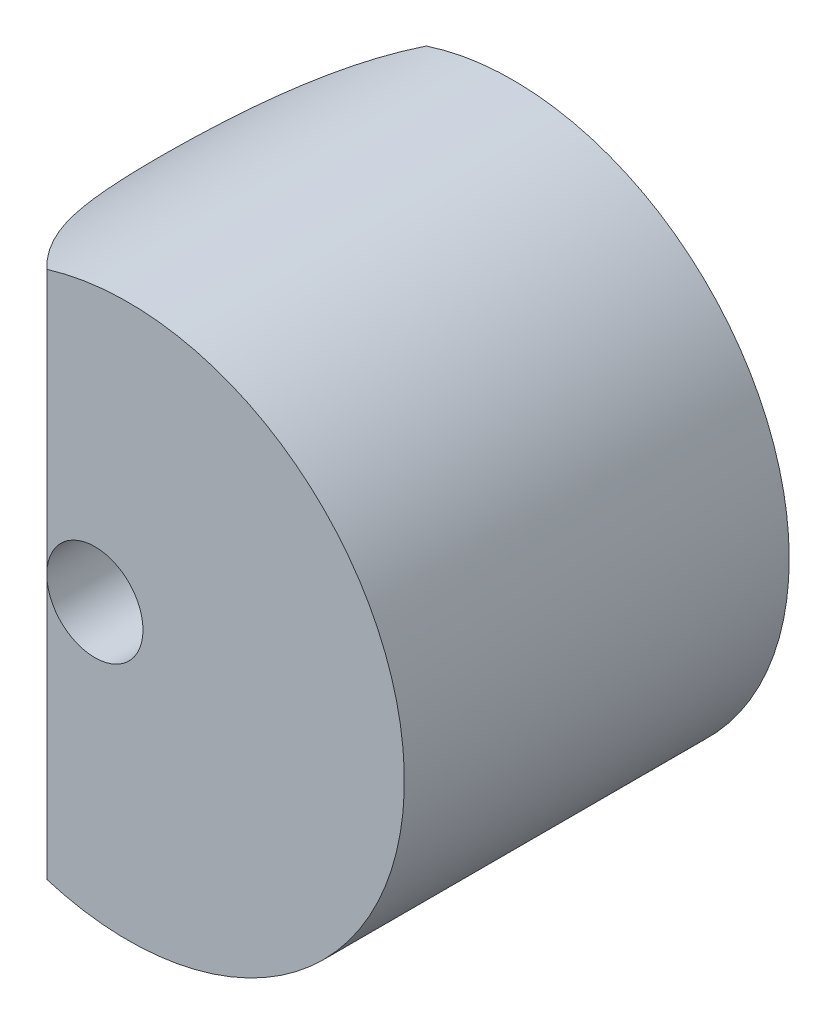
ISO-10303-21;
HEADER;
FILE_DESCRIPTION(('STEP AP214'),'2;1');
FILE_NAME('part.step','',(''),(''),'','','');
FILE_SCHEMA(('AUTOMOTIVE_DESIGN { 1 0 10303 214 1 1 1 1 }'));
ENDSEC;
DATA;
#1=APPLICATION_CONTEXT('core data for automotive mechanical design processes');
#2=APPLICATION_PROTOCOL_DEFINITION('international standard','automotive_design',2000,#1);
#3=PRODUCT_CONTEXT('',#1,'mechanical');
#4=PRODUCT('Part','Part','',(#3));
#5=PRODUCT_RELATED_PRODUCT_CATEGORY('part','',(#4));
#6=PRODUCT_DEFINITION_FORMATION('','',#4);
#7=PRODUCT_DEFINITION_CONTEXT('part definition',#1,'design');
#8=PRODUCT_DEFINITION('design','',#6,#7);
#9=PRODUCT_DEFINITION_SHAPE('','',#8);
#10=(LENGTH_UNIT() NAMED_UNIT(*) SI_UNIT(.MILLI.,.METRE.));
#11=(NAMED_UNIT(*) PLANE_ANGLE_UNIT() SI_UNIT($,.RADIAN.));
#12=(NAMED_UNIT(*) SI_UNIT($,.STERADIAN.) SOLID_ANGLE_UNIT());
#13=UNCERTAINTY_MEASURE_WITH_UNIT(LENGTH_MEASURE(1.E-05),#10,'distance_accuracy_value','');
#14=(GEOMETRIC_REPRESENTATION_CONTEXT(3) GLOBAL_UNCERTAINTY_ASSIGNED_CONTEXT((#13)) GLOBAL_UNIT_ASSIGNED_CONTEXT((#10,
#11,#12)) REPRESENTATION_CONTEXT('',''));
#15=CARTESIAN_POINT('',(0.,0.,0.));
#16=DIRECTION('',(0.,0.,1.));
#17=DIRECTION('',(1.,0.,0.));
#18=AXIS2_PLACEMENT_3D('',#15,#16,#17);
#19=CARTESIAN_POINT('',(0.,0.,-40.));
#20=DIRECTION('',(0.,0.,-1.));
#21=DIRECTION('',(-1.,0.,0.));
#22=AXIS2_PLACEMENT_3D('',#19,#20,#21);
#23=PLANE('',#22);
#24=CARTESIAN_POINT('',(-6.88233167500708,0.,-40.));
#25=DIRECTION('',(0.,0.,1.));
#26=DIRECTION('',(1.,0.,0.));
#27=AXIS2_PLACEMENT_3D('',#24,#25,#26);
#28=CIRCLE('',#27,10.);
#29=CARTESIAN_POINT('',(3.11766832499292,0.,-40.));
#30=VERTEX_POINT('',#29);
#31=EDGE_CURVE('E68',#30,#30,#28,.T.);
#32=ORIENTED_EDGE('',*,*,#31,.T.);
#33=EDGE_LOOP('',(#32));
#34=FACE_BOUND('',#33,.T.);
#35=DIRECTION('',(0.,1.,0.));
#36=VECTOR('',#35,1.);
#37=CARTESIAN_POINT('',(-18.0066930328158,-57.45,-40.));
#38=LINE('',#37,#36);
#39=CARTESIAN_POINT('',(-18.0066930328158,-54.5551235542726,-40.));
#40=VERTEX_POINT('',#39);
#41=CARTESIAN_POINT('',(-18.0066930328158,54.5551235542726,-40.));
#42=VERTEX_POINT('',#41);
#43=EDGE_CURVE('E61',#40,#42,#38,.T.);
#44=ORIENTED_EDGE('',*,*,#43,.T.);
#45=CARTESIAN_POINT('',(0.,0.,-40.));
#46=DIRECTION('',(0.,0.,1.));
#47=DIRECTION('',(1.,0.,0.));
#48=AXIS2_PLACEMENT_3D('',#45,#46,#47);
#49=CIRCLE('',#48,57.45);
#50=EDGE_CURVE('E73',#40,#42,#49,.T.);
#51=ORIENTED_EDGE('',*,*,#50,.F.);
#52=EDGE_LOOP('',(#44,#51));
#53=FACE_BOUND('',#52,.T.);
#54=ADVANCED_FACE('F33',(#34,#53),#23,.T.);
#55=CARTESIAN_POINT('',(0.,0.,40.));
#56=DIRECTION('',(0.,0.,1.));
#57=DIRECTION('',(1.,0.,0.));
#58=AXIS2_PLACEMENT_3D('',#55,#56,#57);
#59=CYLINDRICAL_SURFACE('',#58,57.45);
#60=CARTESIAN_POINT('',(-18.0066930328158,-54.5551235542726,-40.));
#61=CARTESIAN_POINT('',(-18.5645443932268,-54.3709958209803,-39.426314449442));
#62=CARTESIAN_POINT('',(-19.1093183545207,-54.1816969679083,-38.8417502057396));
#63=CARTESIAN_POINT('',(-20.1723327322114,-53.7949759197827,-37.6516397851039));
#64=CARTESIAN_POINT('',(-20.6905751405838,-53.5975543365929,-37.0460951891057));
#65=CARTESIAN_POINT('',(-22.2047834202795,-52.9965001450388,-35.1993591597268));
#66=CARTESIAN_POINT('',(-23.1605362250626,-52.5839748398352,-33.9277504960627));
#67=CARTESIAN_POINT('',(-24.9697560966223,-51.749553150489,-31.2971764534986));
#68=CARTESIAN_POINT('',(-25.8221256778058,-51.3276045140148,-29.9374754055808));
#69=CARTESIAN_POINT('',(-27.4100191843729,-50.4974845032113,-27.1473076156849));
#70=CARTESIAN_POINT('',(-28.1455367457462,-50.0893138802148,-25.7168370250065));
#71=CARTESIAN_POINT('',(-29.4968525204201,-49.305680790147,-22.7867389936955));
#72=CARTESIAN_POINT('',(-30.112348187383,-48.9303022646679,-21.2869482794485));
#73=CARTESIAN_POINT('',(-30.9396293650138,-48.4081408830237,-18.9936756580266));
#74=CARTESIAN_POINT('',(-31.1994298000444,-48.2408814220698,-18.2218605080707));
#75=CARTESIAN_POINT('',(-31.6862757932922,-47.9225109474876,-16.6647246434082));
#76=CARTESIAN_POINT('',(-31.9133257645899,-47.7713977588838,-15.8794057643019));
#77=CARTESIAN_POINT('',(-32.3328676100774,-47.4884397285007,-14.3003137169759));
#78=CARTESIAN_POINT('',(-32.5255199897721,-47.3565059585182,-13.506599152903));
#79=CARTESIAN_POINT('',(-32.8767885943964,-47.1133200806307,-11.9086414306983));
#80=CARTESIAN_POINT('',(-33.0354099160587,-47.002064876091,-11.104399868334));
#81=CARTESIAN_POINT('',(-33.3178977251736,-46.8022450732026,-9.48711722901848));
#82=CARTESIAN_POINT('',(-33.441767951429,-46.7136780339675,-8.67407710846984));
#83=CARTESIAN_POINT('',(-33.6541325835557,-46.5609172822938,-7.04111989678282));
#84=CARTESIAN_POINT('',(-33.7426283584746,-46.4967226266098,-6.22120307303797));
#85=CARTESIAN_POINT('',(-33.8755177531385,-46.399975029864,-4.67268731047663));
#86=CARTESIAN_POINT('',(-33.9238532655929,-46.3646034868259,-3.94459957647339));
#87=CARTESIAN_POINT('',(-33.9923242000875,-46.3144277902229,-2.48640045263524));
#88=CARTESIAN_POINT('',(-34.0124604136192,-46.2996230593936,-1.75628912017458));
#89=CARTESIAN_POINT('',(-34.0244380619356,-46.2908216194581,-0.295754029242824));
#90=CARTESIAN_POINT('',(-34.0162811904103,-46.2968236648098,0.434669707909777));
#91=CARTESIAN_POINT('',(-33.9717155439755,-46.3295348950134,1.89419266354267));
#92=CARTESIAN_POINT('',(-33.9353065843118,-46.3562442152803,2.62329187332998));
#93=CARTESIAN_POINT('',(-33.8343507966005,-46.429980723886,4.07930860672693));
#94=CARTESIAN_POINT('',(-33.7697731582222,-46.4770301593279,4.80622286138705));
#95=CARTESIAN_POINT('',(-33.6127649266582,-46.5907062547661,6.25548983349343));
#96=CARTESIAN_POINT('',(-33.5203342033894,-46.6573330061949,6.97784252961963));
#97=CARTESIAN_POINT('',(-33.3080134620402,-46.8091419905014,8.41649481065234));
#98=CARTESIAN_POINT('',(-33.1881249664072,-46.89432319458,9.13279472888399));
#99=CARTESIAN_POINT('',(-32.921355136235,-47.0819857377702,10.5580871897739));
#100=CARTESIAN_POINT('',(-32.7744711385423,-47.1844687836574,11.2670790041808));
#101=CARTESIAN_POINT('',(-32.3280872960568,-47.4923013520559,13.2316431750454));
#102=CARTESIAN_POINT('',(-31.9994864583048,-47.7151079606837,14.4780130035814));
#103=CARTESIAN_POINT('',(-31.2608818485402,-48.2022304186917,16.9376508379387));
#104=CARTESIAN_POINT('',(-30.8508865789175,-48.4665419319043,18.1509222861435));
#105=CARTESIAN_POINT('',(-29.9522305857804,-49.0270011517408,20.541187422098));
#106=CARTESIAN_POINT('',(-29.4635245418352,-49.3231671668543,21.7181597413787));
#107=CARTESIAN_POINT('',(-28.4103181912386,-49.9372394779971,24.0318589336961));
#108=CARTESIAN_POINT('',(-27.8458100121776,-50.2551480304067,25.1685816111016));
#109=CARTESIAN_POINT('',(-26.5620883159623,-50.9466260162927,27.5496484836979));
#110=CARTESIAN_POINT('',(-25.8322775972522,-51.3219138753927,28.7877922021472));
#111=CARTESIAN_POINT('',(-24.280874477332,-52.0738403379162,31.2046953834504));
#112=CARTESIAN_POINT('',(-23.4592810191204,-52.450478956847,32.3834541621799));
#113=CARTESIAN_POINT('',(-21.7285908212959,-53.1907357478733,34.6750940266342));
#114=CARTESIAN_POINT('',(-20.8196860194672,-53.5543801739085,35.7881113058724));
#115=CARTESIAN_POINT('',(-18.9152909561183,-54.2562946462726,37.9462619700348));
#116=CARTESIAN_POINT('',(-17.9197863377337,-54.5945604678563,38.9913840486615));
#117=CARTESIAN_POINT('',(-16.8823316750071,-54.9134717279381,40.));
#118=B_SPLINE_CURVE_WITH_KNOTS('',3,(#60,#61,#62,#63,#64,#65,#66,#67,#68,#69,#70,#71,#72,#73,
#74,#75,#76,#77,#78,#79,#80,#81,#82,#83,#84,#85,#86,#87,#88,#89,#90,#91,#92,#93,#94,#95,#96,#97,
#98,#99,#100,#101,#102,#103,#104,#105,#106,#107,#108,#109,#110,#111,#112,#113,#114,#115,#116,
#117),.UNSPECIFIED.,.F.,.F.,(4,2,2,2,2,2,2,2,2,2,2,2,2,2,2,2,2,2,2,2,2,2,2,2,2,2,2,2,4),(0.,
2.46289811600804,4.92561104685861,9.84968807738903,14.8221550974034,19.7948928358093,
24.7800080513592,27.2733607573359,29.766377172927,32.2474380528556,34.7281270917172,
37.2085491356228,39.6888751739343,41.8797063895543,44.0704761121966,46.2611146925227,
48.4517675986282,50.6448226284994,52.8378879008173,55.0308316039588,57.2239917610667,
61.14406931757,65.0637376015161,68.9856708908476,72.9080118069449,77.3601168540264,
81.8122731783693,86.2548569796074,90.6981786989325),.UNSPECIFIED.);
#119=CARTESIAN_POINT('',(-16.8823316750071,-54.9134717279381,40.));
#120=VERTEX_POINT('',#119);
#121=EDGE_CURVE('E51',#40,#120,#118,.T.);
#122=ORIENTED_EDGE('',*,*,#121,.F.);
#123=ORIENTED_EDGE('',*,*,#50,.T.);
#124=CARTESIAN_POINT('',(-16.8823316750071,54.9134717279381,40.));
#125=CARTESIAN_POINT('',(-17.4601735248991,54.7358217910518,39.4382451010559));
#126=CARTESIAN_POINT('',(-18.024980783448,54.5521975534782,38.8651682666922));
#127=CARTESIAN_POINT('',(-19.128100892657,54.1752530832386,37.6972216407944));
#128=CARTESIAN_POINT('',(-19.6664162364412,53.9819337664359,37.1023539092031));
#129=CARTESIAN_POINT('',(-21.240693804955,53.3909291578937,35.2867003798506));
#130=CARTESIAN_POINT('',(-22.2364864764387,52.9820401616445,34.0343784593398));
#131=CARTESIAN_POINT('',(-24.1253784519025,52.1492471587399,31.4410917656546));
#132=CARTESIAN_POINT('',(-25.0174706827768,51.7252409992057,30.0994294542904));
#133=CARTESIAN_POINT('',(-26.685173122987,50.8849272273197,27.3429497742558));
#134=CARTESIAN_POINT('',(-27.4607722821493,50.4686203485782,25.9281254827556));
#135=CARTESIAN_POINT('',(-28.8921030661481,49.6631100977676,23.0287750812196));
#136=CARTESIAN_POINT('',(-29.5476493128725,49.2739492069434,21.5441455510289));
#137=CARTESIAN_POINT('',(-30.7321069909961,48.5440500568092,18.5131427247295));
#138=CARTESIAN_POINT('',(-31.2610214367502,48.2033106449485,16.9667708993626));
#139=CARTESIAN_POINT('',(-31.9534601642329,47.7446830914907,14.6116443355081));
#140=CARTESIAN_POINT('',(-32.1671105756357,47.6007993533427,13.8223526887829));
#141=CARTESIAN_POINT('',(-32.5606251361708,47.3324942248326,12.23216436624));
#142=CARTESIAN_POINT('',(-32.7404942406634,47.2080699804172,11.4312694110995));
#143=CARTESIAN_POINT('',(-33.0656605675692,46.9808889763217,9.81952796786673));
#144=CARTESIAN_POINT('',(-33.2109610288571,46.8781301868211,9.00868241957714));
#145=CARTESIAN_POINT('',(-33.4663030049813,46.6961849908542,7.3788315212376));
#146=CARTESIAN_POINT('',(-33.5763457521069,46.6169977605474,6.559826457402));
#147=CARTESIAN_POINT('',(-33.7510858417161,46.4906125756322,5.00051726988326));
#148=CARTESIAN_POINT('',(-33.8192880917825,46.4409585962942,4.26080282524707));
#149=CARTESIAN_POINT('',(-33.9265408596716,46.362665576919,2.77815949171538));
#150=CARTESIAN_POINT('',(-33.9655920986478,46.3340260170162,2.03523068279589));
#151=CARTESIAN_POINT('',(-34.0143533959563,46.2982416360567,0.547935250925584));
#152=CARTESIAN_POINT('',(-34.0240651366813,46.2910955825144,-0.19643128713324));
#153=CARTESIAN_POINT('',(-34.0141048062017,46.2984147889774,-1.68486467014533));
#154=CARTESIAN_POINT('',(-33.9944325926827,46.3128801536527,-2.42893151362963));
#155=CARTESIAN_POINT('',(-33.9257768828717,46.3631962889245,-3.91549377017655));
#156=CARTESIAN_POINT('',(-33.8767733428849,46.3990616832755,-4.6579877599126));
#157=CARTESIAN_POINT('',(-33.7496737923732,46.4915925714293,-6.13917352883592));
#158=CARTESIAN_POINT('',(-33.6715776055827,46.548258191256,-6.87786528495885));
#159=CARTESIAN_POINT('',(-33.4866518535533,46.6814699855065,-8.3497846306243));
#160=CARTESIAN_POINT('',(-33.3798243579954,46.7580147279095,-9.08301260984561));
#161=CARTESIAN_POINT('',(-33.137889167585,46.9297848370259,-10.5426057965359));
#162=CARTESIAN_POINT('',(-33.0027786456229,47.0250120711408,-11.2689703103563));
#163=CARTESIAN_POINT('',(-32.5933489001837,47.3104372468896,-13.2536467659326));
#164=CARTESIAN_POINT('',(-32.2904738124326,47.5184103435429,-14.5036511332743));
#165=CARTESIAN_POINT('',(-31.6030387526938,47.978338565588,-16.9722690522136));
#166=CARTESIAN_POINT('',(-31.2184883427318,48.2302885418326,-18.19088625971));
#167=CARTESIAN_POINT('',(-30.370358140902,48.7688041795361,-20.5936304585977));
#168=CARTESIAN_POINT('',(-29.9067094457526,49.0553999573164,-21.7777263160813));
#169=CARTESIAN_POINT('',(-28.9034051637093,49.6531630937924,-24.1068753043064));
#170=CARTESIAN_POINT('',(-28.3637424946676,49.9643327408235,-25.251924784774));
#171=CARTESIAN_POINT('',(-27.1459892106429,50.6372832497635,-27.6265295296914));
#172=CARTESIAN_POINT('',(-26.4591566322526,51.0008208552587,-28.851110579933));
#173=CARTESIAN_POINT('',(-24.9972540418634,51.7330479550444,-31.2447318359447));
#174=CARTESIAN_POINT('',(-24.2221820419534,52.1017375652384,-32.4137707895877));
#175=CARTESIAN_POINT('',(-22.5884392599321,52.8305060099555,-34.6894121649318));
#176=CARTESIAN_POINT('',(-21.730020565982,53.19060694472,-35.7961877984392));
#177=CARTESIAN_POINT('',(-20.380181644628,53.7157705241001,-37.4088931639863));
#178=CARTESIAN_POINT('',(-19.9198125046589,53.888345335721,-37.9386078932349));
#179=CARTESIAN_POINT('',(-18.9785688992609,54.2269908759002,-38.9816950422757));
#180=CARTESIAN_POINT('',(-18.4976933376159,54.3930612558371,-39.4950665858382));
#181=CARTESIAN_POINT('',(-18.0066930328157,54.5551235542726,-40.));
#182=B_SPLINE_CURVE_WITH_KNOTS('',3,(#124,#125,#126,#127,#128,#129,#130,#131,#132,#133,#134,
#135,#136,#137,#138,#139,#140,#141,#142,#143,#144,#145,#146,#147,#148,#149,#150,#151,#152,#153,
#154,#155,#156,#157,#158,#159,#160,#161,#162,#163,#164,#165,#166,#167,#168,#169,#170,#171,#172,
#173,#174,#175,#176,#177,#178,#179,#180,#181),.UNSPECIFIED.,.F.,.F.,(4,2,2,2,2,2,2,2,2,2,2,2,2,
2,2,2,2,2,2,2,2,2,2,2,2,2,2,2,4),(0.,2.47528768461199,4.95034197549445,9.89831609475352,
14.8909111328728,19.883979454478,24.8846939177079,29.8852893316419,32.3752485015347,
34.8648421349996,37.3542024165172,39.8434756831253,42.0761589474411,44.3087869766047,
46.5412869794418,48.7737977949145,51.0078359512864,53.2418876433955,55.4757784470169,
57.7098926522008,61.6143199825224,65.5182904591166,69.4256792512616,73.3334323321087,
77.6805611092078,82.0277878404363,86.3622530401949,88.5299651395998,90.6977932644617),.UNSPECIFIED.);
#183=CARTESIAN_POINT('',(-16.8823316750071,54.9134717279381,40.));
#184=VERTEX_POINT('',#183);
#185=EDGE_CURVE('E64',#184,#42,#182,.T.);
#186=ORIENTED_EDGE('',*,*,#185,.F.);
#187=CARTESIAN_POINT('',(0.,0.,40.));
#188=DIRECTION('',(0.,0.,1.));
#189=DIRECTION('',(1.,0.,0.));
#190=AXIS2_PLACEMENT_3D('',#187,#188,#189);
#191=CIRCLE('',#190,57.45);
#192=EDGE_CURVE('E75',#120,#184,#191,.T.);
#193=ORIENTED_EDGE('',*,*,#192,.F.);
#194=EDGE_LOOP('',(#122,#123,#186,#193));
#195=FACE_BOUND('',#194,.T.);
#196=ADVANCED_FACE('F72',(#195),#59,.T.);
#197=CARTESIAN_POINT('',(0.,0.,40.));
#198=DIRECTION('',(0.,0.,1.));
#199=DIRECTION('',(1.,0.,0.));
#200=AXIS2_PLACEMENT_3D('',#197,#198,#199);
#201=PLANE('',#200);
#202=DIRECTION('',(0.,1.,0.));
#203=VECTOR('',#202,1.);
#204=CARTESIAN_POINT('',(-16.8823316750071,-57.45,40.));
#205=LINE('',#204,#203);
#206=CARTESIAN_POINT('',(-16.8823316750071,0.,40.));
#207=VERTEX_POINT('',#206);
#208=EDGE_CURVE('E40',#207,#184,#205,.T.);
#209=ORIENTED_EDGE('',*,*,#208,.F.);
#210=CARTESIAN_POINT('',(-6.88233167500708,0.,40.));
#211=DIRECTION('',(0.,0.,1.));
#212=DIRECTION('',(1.,0.,0.));
#213=AXIS2_PLACEMENT_3D('',#210,#211,#212);
#214=CIRCLE('',#213,10.);
#215=EDGE_CURVE('E45',#207,#207,#214,.T.);
#216=ORIENTED_EDGE('',*,*,#215,.F.);
#217=EDGE_CURVE('E11',#120,#207,#205,.T.);
#218=ORIENTED_EDGE('',*,*,#217,.F.);
#219=ORIENTED_EDGE('',*,*,#192,.T.);
#220=EDGE_LOOP('',(#209,#216,#218,#219));
#221=FACE_BOUND('',#220,.T.);
#222=ADVANCED_FACE('F94',(#221),#201,.T.);
#223=CARTESIAN_POINT('',(22.5496484453219,-57.45,-0.562098611758048));
#224=DIRECTION('',(0.,1.,0.));
#225=DIRECTION('',(0.,0.,1.));
#226=AXIS2_PLACEMENT_3D('',#223,#224,#225);
#227=CYLINDRICAL_SURFACE('',#226,56.57);
#228=ORIENTED_EDGE('',*,*,#121,.T.);
#229=ORIENTED_EDGE('',*,*,#217,.T.);
#230=ORIENTED_EDGE('',*,*,#208,.T.);
#231=ORIENTED_EDGE('',*,*,#185,.T.);
#232=ORIENTED_EDGE('',*,*,#43,.F.);
#233=EDGE_LOOP('',(#228,#229,#230,#231,#232));
#234=FACE_BOUND('',#233,.T.);
#235=ADVANCED_FACE('F62',(#234),#227,.T.);
#236=CARTESIAN_POINT('',(-6.88233167500708,0.,-40.));
#237=DIRECTION('',(0.,0.,1.));
#238=DIRECTION('',(1.,0.,0.));
#239=AXIS2_PLACEMENT_3D('',#236,#237,#238);
#240=CYLINDRICAL_SURFACE('',#239,10.);
#241=ORIENTED_EDGE('',*,*,#31,.F.);
#242=EDGE_LOOP('',(#241));
#243=FACE_BOUND('',#242,.T.);
#244=ORIENTED_EDGE('',*,*,#215,.T.);
#245=EDGE_LOOP('',(#244));
#246=FACE_BOUND('',#245,.T.);
#247=ADVANCED_FACE('F93',(#243,#246),#240,.F.);
#248=CLOSED_SHELL('',(#54,#196,#222,#235,#247));
#249=MANIFOLD_SOLID_BREP('B2',#248);
#250=ADVANCED_BREP_SHAPE_REPRESENTATION('',(#18,#249),#14);
#251=SHAPE_DEFINITION_REPRESENTATION(#9,#250);
ENDSEC;
END-ISO-10303-21;
